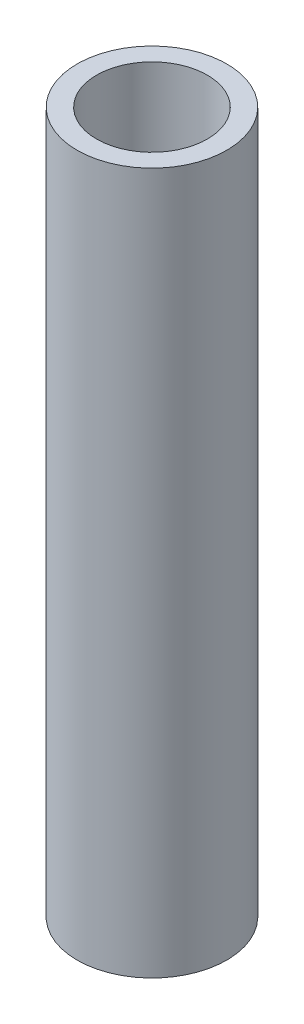
ISO-10303-21;
HEADER;
FILE_DESCRIPTION(('STEP AP214'),'2;1');
FILE_NAME('part.step','',(''),(''),'','','');
FILE_SCHEMA(('AUTOMOTIVE_DESIGN { 1 0 10303 214 1 1 1 1 }'));
ENDSEC;
DATA;
#1=APPLICATION_CONTEXT('core data for automotive mechanical design processes');
#2=APPLICATION_PROTOCOL_DEFINITION('international standard','automotive_design',2000,#1);
#3=PRODUCT_CONTEXT('',#1,'mechanical');
#4=PRODUCT('Part','Part','',(#3));
#5=PRODUCT_RELATED_PRODUCT_CATEGORY('part','',(#4));
#6=PRODUCT_DEFINITION_FORMATION('','',#4);
#7=PRODUCT_DEFINITION_CONTEXT('part definition',#1,'design');
#8=PRODUCT_DEFINITION('design','',#6,#7);
#9=PRODUCT_DEFINITION_SHAPE('','',#8);
#10=(LENGTH_UNIT() NAMED_UNIT(*) SI_UNIT(.MILLI.,.METRE.));
#11=(NAMED_UNIT(*) PLANE_ANGLE_UNIT() SI_UNIT($,.RADIAN.));
#12=(NAMED_UNIT(*) SI_UNIT($,.STERADIAN.) SOLID_ANGLE_UNIT());
#13=UNCERTAINTY_MEASURE_WITH_UNIT(LENGTH_MEASURE(1.E-05),#10,'distance_accuracy_value','');
#14=(GEOMETRIC_REPRESENTATION_CONTEXT(3) GLOBAL_UNCERTAINTY_ASSIGNED_CONTEXT((#13)) GLOBAL_UNIT_ASSIGNED_CONTEXT((#10,
#11,#12)) REPRESENTATION_CONTEXT('',''));
#15=CARTESIAN_POINT('',(0.,0.,0.));
#16=DIRECTION('',(0.,0.,1.));
#17=DIRECTION('',(1.,0.,0.));
#18=AXIS2_PLACEMENT_3D('',#15,#16,#17);
#19=CARTESIAN_POINT('',(0.,100.,0.));
#20=DIRECTION('',(0.,1.,0.));
#21=DIRECTION('',(0.,0.,1.));
#22=AXIS2_PLACEMENT_3D('',#19,#20,#21);
#23=PLANE('',#22);
#24=CARTESIAN_POINT('',(0.,100.,0.));
#25=DIRECTION('',(0.,1.,0.));
#26=DIRECTION('',(0.,0.,1.));
#27=AXIS2_PLACEMENT_3D('',#24,#25,#26);
#28=CIRCLE('',#27,10.668);
#29=CARTESIAN_POINT('',(0.,100.,10.668));
#30=VERTEX_POINT('',#29);
#31=EDGE_CURVE('E10',#30,#30,#28,.T.);
#32=ORIENTED_EDGE('',*,*,#31,.T.);
#33=EDGE_LOOP('',(#32));
#34=FACE_BOUND('',#33,.T.);
#35=CARTESIAN_POINT('',(0.,100.,0.));
#36=DIRECTION('',(0.,1.,0.));
#37=DIRECTION('',(0.,0.,1.));
#38=AXIS2_PLACEMENT_3D('',#35,#36,#37);
#39=CIRCLE('',#38,7.8994);
#40=CARTESIAN_POINT('',(0.,100.,7.8994));
#41=VERTEX_POINT('',#40);
#42=EDGE_CURVE('E44',#41,#41,#39,.T.);
#43=ORIENTED_EDGE('',*,*,#42,.F.);
#44=EDGE_LOOP('',(#43));
#45=FACE_BOUND('',#44,.T.);
#46=ADVANCED_FACE('F33',(#34,#45),#23,.T.);
#47=CARTESIAN_POINT('',(0.,0.,0.));
#48=DIRECTION('',(0.,1.,0.));
#49=DIRECTION('',(0.,0.,1.));
#50=AXIS2_PLACEMENT_3D('',#47,#48,#49);
#51=PLANE('',#50);
#52=CARTESIAN_POINT('',(0.,0.,0.));
#53=DIRECTION('',(0.,1.,0.));
#54=DIRECTION('',(0.,0.,1.));
#55=AXIS2_PLACEMENT_3D('',#52,#53,#54);
#56=CIRCLE('',#55,10.668);
#57=CARTESIAN_POINT('',(0.,0.,10.668));
#58=VERTEX_POINT('',#57);
#59=EDGE_CURVE('E37',#58,#58,#56,.T.);
#60=ORIENTED_EDGE('',*,*,#59,.F.);
#61=EDGE_LOOP('',(#60));
#62=FACE_BOUND('',#61,.T.);
#63=CARTESIAN_POINT('',(0.,0.,0.));
#64=DIRECTION('',(0.,1.,0.));
#65=DIRECTION('',(0.,0.,1.));
#66=AXIS2_PLACEMENT_3D('',#63,#64,#65);
#67=CIRCLE('',#66,7.8994);
#68=CARTESIAN_POINT('',(0.,0.,7.8994));
#69=VERTEX_POINT('',#68);
#70=EDGE_CURVE('E46',#69,#69,#67,.T.);
#71=ORIENTED_EDGE('',*,*,#70,.T.);
#72=EDGE_LOOP('',(#71));
#73=FACE_BOUND('',#72,.T.);
#74=ADVANCED_FACE('F56',(#62,#73),#51,.F.);
#75=CARTESIAN_POINT('',(0.,100.,0.));
#76=DIRECTION('',(0.,-1.,0.));
#77=DIRECTION('',(0.,0.,-1.));
#78=AXIS2_PLACEMENT_3D('',#75,#76,#77);
#79=CYLINDRICAL_SURFACE('',#78,10.668);
#80=ORIENTED_EDGE('',*,*,#31,.F.);
#81=EDGE_LOOP('',(#80));
#82=FACE_BOUND('',#81,.T.);
#83=ORIENTED_EDGE('',*,*,#59,.T.);
#84=EDGE_LOOP('',(#83));
#85=FACE_BOUND('',#84,.T.);
#86=ADVANCED_FACE('F35',(#82,#85),#79,.T.);
#87=CARTESIAN_POINT('',(0.,100.,0.));
#88=DIRECTION('',(0.,-1.,0.));
#89=DIRECTION('',(0.,0.,-1.));
#90=AXIS2_PLACEMENT_3D('',#87,#88,#89);
#91=CYLINDRICAL_SURFACE('',#90,7.8994);
#92=ORIENTED_EDGE('',*,*,#42,.T.);
#93=EDGE_LOOP('',(#92));
#94=FACE_BOUND('',#93,.T.);
#95=ORIENTED_EDGE('',*,*,#70,.F.);
#96=EDGE_LOOP('',(#95));
#97=FACE_BOUND('',#96,.T.);
#98=ADVANCED_FACE('F52',(#94,#97),#91,.F.);
#99=CLOSED_SHELL('',(#46,#74,#86,#98));
#100=MANIFOLD_SOLID_BREP('B2',#99);
#101=ADVANCED_BREP_SHAPE_REPRESENTATION('',(#18,#100),#14);
#102=SHAPE_DEFINITION_REPRESENTATION(#9,#101);
ENDSEC;
END-ISO-10303-21;
